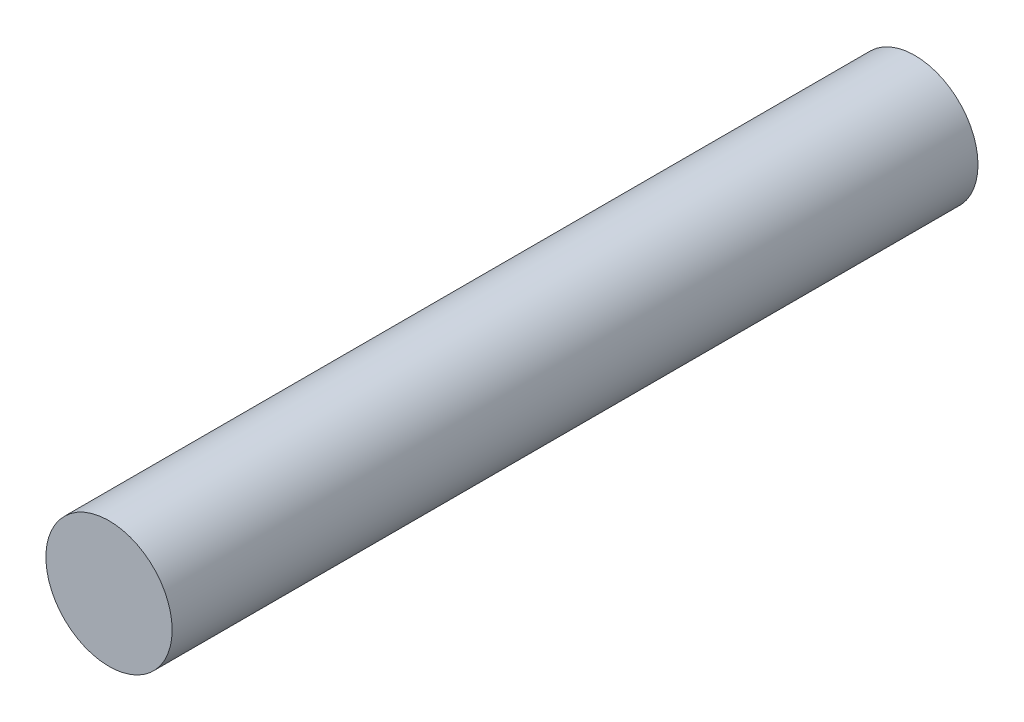
ISO-10303-21;
HEADER;
FILE_DESCRIPTION(('STEP AP214'),'2;1');
FILE_NAME('part.step','',(''),(''),'','','');
FILE_SCHEMA(('AUTOMOTIVE_DESIGN { 1 0 10303 214 1 1 1 1 }'));
ENDSEC;
DATA;
#1=APPLICATION_CONTEXT('core data for automotive mechanical design processes');
#2=APPLICATION_PROTOCOL_DEFINITION('international standard','automotive_design',2000,#1);
#3=PRODUCT_CONTEXT('',#1,'mechanical');
#4=PRODUCT('Part','Part','',(#3));
#5=PRODUCT_RELATED_PRODUCT_CATEGORY('part','',(#4));
#6=PRODUCT_DEFINITION_FORMATION('','',#4);
#7=PRODUCT_DEFINITION_CONTEXT('part definition',#1,'design');
#8=PRODUCT_DEFINITION('design','',#6,#7);
#9=PRODUCT_DEFINITION_SHAPE('','',#8);
#10=(LENGTH_UNIT() NAMED_UNIT(*) SI_UNIT(.MILLI.,.METRE.));
#11=(NAMED_UNIT(*) PLANE_ANGLE_UNIT() SI_UNIT($,.RADIAN.));
#12=(NAMED_UNIT(*) SI_UNIT($,.STERADIAN.) SOLID_ANGLE_UNIT());
#13=UNCERTAINTY_MEASURE_WITH_UNIT(LENGTH_MEASURE(1.E-05),#10,'distance_accuracy_value','');
#14=(GEOMETRIC_REPRESENTATION_CONTEXT(3) GLOBAL_UNCERTAINTY_ASSIGNED_CONTEXT((#13)) GLOBAL_UNIT_ASSIGNED_CONTEXT((#10,
#11,#12)) REPRESENTATION_CONTEXT('',''));
#15=CARTESIAN_POINT('',(0.,0.,0.));
#16=DIRECTION('',(0.,0.,1.));
#17=DIRECTION('',(1.,0.,0.));
#18=AXIS2_PLACEMENT_3D('',#15,#16,#17);
#19=CARTESIAN_POINT('',(0.,0.,60.));
#20=DIRECTION('',(0.,0.,-1.));
#21=DIRECTION('',(-1.,0.,0.));
#22=AXIS2_PLACEMENT_3D('',#19,#20,#21);
#23=CYLINDRICAL_SURFACE('',#22,4.7);
#24=CARTESIAN_POINT('',(0.,0.,60.));
#25=DIRECTION('',(0.,0.,1.));
#26=DIRECTION('',(1.,0.,0.));
#27=AXIS2_PLACEMENT_3D('',#24,#25,#26);
#28=CIRCLE('',#27,4.7);
#29=CARTESIAN_POINT('',(4.7,0.,60.));
#30=VERTEX_POINT('',#29);
#31=EDGE_CURVE('E10',#30,#30,#28,.T.);
#32=ORIENTED_EDGE('',*,*,#31,.F.);
#33=EDGE_LOOP('',(#32));
#34=FACE_BOUND('',#33,.T.);
#35=CARTESIAN_POINT('',(0.,0.,0.));
#36=DIRECTION('',(0.,0.,1.));
#37=DIRECTION('',(1.,0.,0.));
#38=AXIS2_PLACEMENT_3D('',#35,#36,#37);
#39=CIRCLE('',#38,4.7);
#40=CARTESIAN_POINT('',(4.7,0.,0.));
#41=VERTEX_POINT('',#40);
#42=EDGE_CURVE('E35',#41,#41,#39,.T.);
#43=ORIENTED_EDGE('',*,*,#42,.T.);
#44=EDGE_LOOP('',(#43));
#45=FACE_BOUND('',#44,.T.);
#46=ADVANCED_FACE('F29',(#34,#45),#23,.T.);
#47=CARTESIAN_POINT('',(0.,0.,60.));
#48=DIRECTION('',(0.,0.,1.));
#49=DIRECTION('',(1.,0.,0.));
#50=AXIS2_PLACEMENT_3D('',#47,#48,#49);
#51=PLANE('',#50);
#52=ORIENTED_EDGE('',*,*,#31,.T.);
#53=EDGE_LOOP('',(#52));
#54=FACE_BOUND('',#53,.T.);
#55=ADVANCED_FACE('F44',(#54),#51,.T.);
#56=CARTESIAN_POINT('',(0.,0.,0.));
#57=DIRECTION('',(0.,0.,1.));
#58=DIRECTION('',(1.,0.,0.));
#59=AXIS2_PLACEMENT_3D('',#56,#57,#58);
#60=PLANE('',#59);
#61=ORIENTED_EDGE('',*,*,#42,.F.);
#62=EDGE_LOOP('',(#61));
#63=FACE_BOUND('',#62,.T.);
#64=ADVANCED_FACE('F42',(#63),#60,.F.);
#65=CLOSED_SHELL('',(#46,#55,#64));
#66=MANIFOLD_SOLID_BREP('B2',#65);
#67=ADVANCED_BREP_SHAPE_REPRESENTATION('',(#18,#66),#14);
#68=SHAPE_DEFINITION_REPRESENTATION(#9,#67);
ENDSEC;
END-ISO-10303-21;
